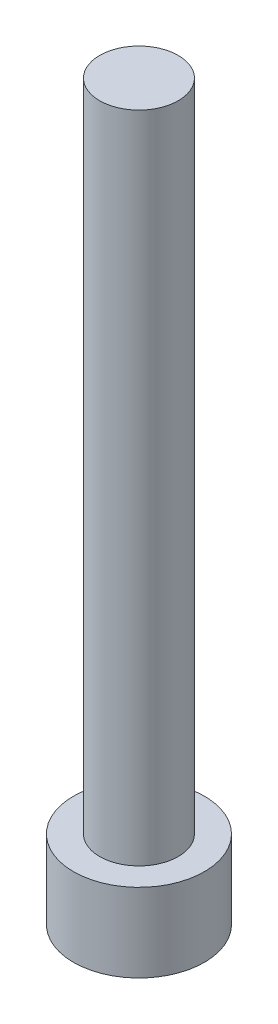
ISO-10303-21;
HEADER;
FILE_DESCRIPTION(('STEP AP214'),'2;1');
FILE_NAME('part.step','',(''),(''),'','','');
FILE_SCHEMA(('AUTOMOTIVE_DESIGN { 1 0 10303 214 1 1 1 1 }'));
ENDSEC;
DATA;
#1=APPLICATION_CONTEXT('core data for automotive mechanical design processes');
#2=APPLICATION_PROTOCOL_DEFINITION('international standard','automotive_design',2000,#1);
#3=PRODUCT_CONTEXT('',#1,'mechanical');
#4=PRODUCT('Part','Part','',(#3));
#5=PRODUCT_RELATED_PRODUCT_CATEGORY('part','',(#4));
#6=PRODUCT_DEFINITION_FORMATION('','',#4);
#7=PRODUCT_DEFINITION_CONTEXT('part definition',#1,'design');
#8=PRODUCT_DEFINITION('design','',#6,#7);
#9=PRODUCT_DEFINITION_SHAPE('','',#8);
#10=(LENGTH_UNIT() NAMED_UNIT(*) SI_UNIT(.MILLI.,.METRE.));
#11=(NAMED_UNIT(*) PLANE_ANGLE_UNIT() SI_UNIT($,.RADIAN.));
#12=(NAMED_UNIT(*) SI_UNIT($,.STERADIAN.) SOLID_ANGLE_UNIT());
#13=UNCERTAINTY_MEASURE_WITH_UNIT(LENGTH_MEASURE(1.E-05),#10,'distance_accuracy_value','');
#14=(GEOMETRIC_REPRESENTATION_CONTEXT(3) GLOBAL_UNCERTAINTY_ASSIGNED_CONTEXT((#13)) GLOBAL_UNIT_ASSIGNED_CONTEXT((#10,
#11,#12)) REPRESENTATION_CONTEXT('',''));
#15=CARTESIAN_POINT('',(0.,0.,0.));
#16=DIRECTION('',(0.,0.,1.));
#17=DIRECTION('',(1.,0.,0.));
#18=AXIS2_PLACEMENT_3D('',#15,#16,#17);
#19=CARTESIAN_POINT('',(0.,3.,0.));
#20=DIRECTION('',(0.,-1.,0.));
#21=DIRECTION('',(0.,0.,-1.));
#22=AXIS2_PLACEMENT_3D('',#19,#20,#21);
#23=CYLINDRICAL_SURFACE('',#22,2.5);
#24=CARTESIAN_POINT('',(0.,3.,0.));
#25=DIRECTION('',(0.,1.,0.));
#26=DIRECTION('',(0.,0.,1.));
#27=AXIS2_PLACEMENT_3D('',#24,#25,#26);
#28=CIRCLE('',#27,2.5);
#29=CARTESIAN_POINT('',(0.,3.,2.5));
#30=VERTEX_POINT('',#29);
#31=EDGE_CURVE('E43',#30,#30,#28,.T.);
#32=ORIENTED_EDGE('',*,*,#31,.F.);
#33=EDGE_LOOP('',(#32));
#34=FACE_BOUND('',#33,.T.);
#35=CARTESIAN_POINT('',(0.,0.,0.));
#36=DIRECTION('',(0.,1.,0.));
#37=DIRECTION('',(0.,0.,1.));
#38=AXIS2_PLACEMENT_3D('',#35,#36,#37);
#39=CIRCLE('',#38,2.5);
#40=CARTESIAN_POINT('',(0.,0.,2.5));
#41=VERTEX_POINT('',#40);
#42=EDGE_CURVE('E38',#41,#41,#39,.T.);
#43=ORIENTED_EDGE('',*,*,#42,.T.);
#44=EDGE_LOOP('',(#43));
#45=FACE_BOUND('',#44,.T.);
#46=ADVANCED_FACE('F35',(#34,#45),#23,.T.);
#47=CARTESIAN_POINT('',(0.,3.,0.));
#48=DIRECTION('',(0.,1.,0.));
#49=DIRECTION('',(0.,0.,1.));
#50=AXIS2_PLACEMENT_3D('',#47,#48,#49);
#51=PLANE('',#50);
#52=CARTESIAN_POINT('',(0.,3.,0.));
#53=DIRECTION('',(0.,1.,0.));
#54=DIRECTION('',(0.,0.,1.));
#55=AXIS2_PLACEMENT_3D('',#52,#53,#54);
#56=CIRCLE('',#55,1.5);
#57=CARTESIAN_POINT('',(0.,3.,1.5));
#58=VERTEX_POINT('',#57);
#59=EDGE_CURVE('E11',#58,#58,#56,.T.);
#60=ORIENTED_EDGE('',*,*,#59,.F.);
#61=EDGE_LOOP('',(#60));
#62=FACE_BOUND('',#61,.T.);
#63=ORIENTED_EDGE('',*,*,#31,.T.);
#64=EDGE_LOOP('',(#63));
#65=FACE_BOUND('',#64,.T.);
#66=ADVANCED_FACE('F155',(#62,#65),#51,.T.);
#67=CARTESIAN_POINT('',(0.,0.,0.));
#68=DIRECTION('',(0.,1.,0.));
#69=DIRECTION('',(0.,0.,1.));
#70=AXIS2_PLACEMENT_3D('',#67,#68,#69);
#71=PLANE('',#70);
#72=DIRECTION('',(-0.5,0.,0.866025403784439));
#73=VECTOR('',#72,1.);
#74=CARTESIAN_POINT('',(1.425,0.,0.));
#75=LINE('',#74,#73);
#76=CARTESIAN_POINT('',(1.425,0.,0.));
#77=VERTEX_POINT('',#76);
#78=CARTESIAN_POINT('',(0.7125,0.,1.23408620039283));
#79=VERTEX_POINT('',#78);
#80=EDGE_CURVE('E125',#77,#79,#75,.T.);
#81=ORIENTED_EDGE('',*,*,#80,.F.);
#82=DIRECTION('',(0.5,0.,0.866025403784439));
#83=VECTOR('',#82,1.);
#84=CARTESIAN_POINT('',(0.7125,0.,-1.23408620039283));
#85=LINE('',#84,#83);
#86=CARTESIAN_POINT('',(0.7125,0.,-1.23408620039283));
#87=VERTEX_POINT('',#86);
#88=EDGE_CURVE('E51',#87,#77,#85,.T.);
#89=ORIENTED_EDGE('',*,*,#88,.F.);
#90=DIRECTION('',(1.,0.,0.));
#91=VECTOR('',#90,1.);
#92=CARTESIAN_POINT('',(-0.7125,0.,-1.23408620039283));
#93=LINE('',#92,#91);
#94=CARTESIAN_POINT('',(-0.7125,0.,-1.23408620039283));
#95=VERTEX_POINT('',#94);
#96=EDGE_CURVE('E134',#95,#87,#93,.T.);
#97=ORIENTED_EDGE('',*,*,#96,.F.);
#98=DIRECTION('',(0.5,0.,-0.866025403784439));
#99=VECTOR('',#98,1.);
#100=CARTESIAN_POINT('',(-1.425,0.,0.));
#101=LINE('',#100,#99);
#102=CARTESIAN_POINT('',(-1.425,0.,0.));
#103=VERTEX_POINT('',#102);
#104=EDGE_CURVE('E132',#103,#95,#101,.T.);
#105=ORIENTED_EDGE('',*,*,#104,.F.);
#106=DIRECTION('',(-0.5,0.,-0.866025403784439));
#107=VECTOR('',#106,1.);
#108=CARTESIAN_POINT('',(-0.7125,0.,1.23408620039283));
#109=LINE('',#108,#107);
#110=CARTESIAN_POINT('',(-0.7125,0.,1.23408620039283));
#111=VERTEX_POINT('',#110);
#112=EDGE_CURVE('E99',#111,#103,#109,.T.);
#113=ORIENTED_EDGE('',*,*,#112,.F.);
#114=DIRECTION('',(-1.,0.,0.));
#115=VECTOR('',#114,1.);
#116=CARTESIAN_POINT('',(0.7125,0.,1.23408620039283));
#117=LINE('',#116,#115);
#118=EDGE_CURVE('E128',#79,#111,#117,.T.);
#119=ORIENTED_EDGE('',*,*,#118,.F.);
#120=EDGE_LOOP('',(#81,#89,#97,#105,#113,#119));
#121=FACE_BOUND('',#120,.T.);
#122=ORIENTED_EDGE('',*,*,#42,.F.);
#123=EDGE_LOOP('',(#122));
#124=FACE_BOUND('',#123,.T.);
#125=ADVANCED_FACE('F152',(#121,#124),#71,.F.);
#126=CARTESIAN_POINT('',(0.,28.,0.));
#127=DIRECTION('',(0.,-1.,0.));
#128=DIRECTION('',(0.,0.,-1.));
#129=AXIS2_PLACEMENT_3D('',#126,#127,#128);
#130=CYLINDRICAL_SURFACE('',#129,1.5);
#131=CARTESIAN_POINT('',(0.,28.,0.));
#132=DIRECTION('',(0.,1.,0.));
#133=DIRECTION('',(0.,0.,1.));
#134=AXIS2_PLACEMENT_3D('',#131,#132,#133);
#135=CIRCLE('',#134,1.5);
#136=CARTESIAN_POINT('',(0.,28.,1.5));
#137=VERTEX_POINT('',#136);
#138=EDGE_CURVE('E138',#137,#137,#135,.T.);
#139=ORIENTED_EDGE('',*,*,#138,.F.);
#140=EDGE_LOOP('',(#139));
#141=FACE_BOUND('',#140,.T.);
#142=ORIENTED_EDGE('',*,*,#59,.T.);
#143=EDGE_LOOP('',(#142));
#144=FACE_BOUND('',#143,.T.);
#145=ADVANCED_FACE('F154',(#141,#144),#130,.T.);
#146=CARTESIAN_POINT('',(0.,28.,0.));
#147=DIRECTION('',(0.,1.,0.));
#148=DIRECTION('',(0.,0.,1.));
#149=AXIS2_PLACEMENT_3D('',#146,#147,#148);
#150=PLANE('',#149);
#151=ORIENTED_EDGE('',*,*,#138,.T.);
#152=EDGE_LOOP('',(#151));
#153=FACE_BOUND('',#152,.T.);
#154=ADVANCED_FACE('F161',(#153),#150,.T.);
#155=CARTESIAN_POINT('',(0.7125,1.65,-1.23408620039283));
#156=DIRECTION('',(0.866025403784439,0.,-0.5));
#157=DIRECTION('',(-0.5,0.,-0.866025403784439));
#158=AXIS2_PLACEMENT_3D('',#155,#156,#157);
#159=PLANE('',#158);
#160=ORIENTED_EDGE('',*,*,#88,.T.);
#161=DIRECTION('',(0.,-1.,0.));
#162=VECTOR('',#161,1.);
#163=CARTESIAN_POINT('',(1.425,1.65,0.));
#164=LINE('',#163,#162);
#165=CARTESIAN_POINT('',(1.425,1.65,0.));
#166=VERTEX_POINT('',#165);
#167=EDGE_CURVE('E81',#166,#77,#164,.T.);
#168=ORIENTED_EDGE('',*,*,#167,.F.);
#169=DIRECTION('',(0.5,0.,0.866025403784439));
#170=VECTOR('',#169,1.);
#171=CARTESIAN_POINT('',(0.7125,1.65,-1.23408620039283));
#172=LINE('',#171,#170);
#173=CARTESIAN_POINT('',(0.7125,1.65,-1.23408620039283));
#174=VERTEX_POINT('',#173);
#175=EDGE_CURVE('E136',#174,#166,#172,.T.);
#176=ORIENTED_EDGE('',*,*,#175,.F.);
#177=DIRECTION('',(0.,-1.,0.));
#178=VECTOR('',#177,1.);
#179=CARTESIAN_POINT('',(0.7125,1.65,-1.23408620039283));
#180=LINE('',#179,#178);
#181=EDGE_CURVE('E59',#174,#87,#180,.T.);
#182=ORIENTED_EDGE('',*,*,#181,.T.);
#183=EDGE_LOOP('',(#160,#168,#176,#182));
#184=FACE_BOUND('',#183,.T.);
#185=ADVANCED_FACE('F190',(#184),#159,.F.);
#186=CARTESIAN_POINT('',(-0.7125,1.65,-1.23408620039283));
#187=DIRECTION('',(0.,0.,-1.));
#188=DIRECTION('',(-1.,0.,0.));
#189=AXIS2_PLACEMENT_3D('',#186,#187,#188);
#190=PLANE('',#189);
#191=ORIENTED_EDGE('',*,*,#96,.T.);
#192=ORIENTED_EDGE('',*,*,#181,.F.);
#193=DIRECTION('',(1.,0.,0.));
#194=VECTOR('',#193,1.);
#195=CARTESIAN_POINT('',(-0.7125,1.65,-1.23408620039283));
#196=LINE('',#195,#194);
#197=CARTESIAN_POINT('',(-0.7125,1.65,-1.23408620039283));
#198=VERTEX_POINT('',#197);
#199=EDGE_CURVE('E111',#198,#174,#196,.T.);
#200=ORIENTED_EDGE('',*,*,#199,.F.);
#201=DIRECTION('',(0.,-1.,0.));
#202=VECTOR('',#201,1.);
#203=CARTESIAN_POINT('',(-0.7125,1.65,-1.23408620039283));
#204=LINE('',#203,#202);
#205=EDGE_CURVE('E103',#198,#95,#204,.T.);
#206=ORIENTED_EDGE('',*,*,#205,.T.);
#207=EDGE_LOOP('',(#191,#192,#200,#206));
#208=FACE_BOUND('',#207,.T.);
#209=ADVANCED_FACE('F204',(#208),#190,.F.);
#210=CARTESIAN_POINT('',(-1.425,1.65,0.));
#211=DIRECTION('',(-0.866025403784439,0.,-0.5));
#212=DIRECTION('',(-0.5,0.,0.866025403784439));
#213=AXIS2_PLACEMENT_3D('',#210,#211,#212);
#214=PLANE('',#213);
#215=ORIENTED_EDGE('',*,*,#104,.T.);
#216=ORIENTED_EDGE('',*,*,#205,.F.);
#217=DIRECTION('',(0.5,0.,-0.866025403784439));
#218=VECTOR('',#217,1.);
#219=CARTESIAN_POINT('',(-1.425,1.65,0.));
#220=LINE('',#219,#218);
#221=CARTESIAN_POINT('',(-1.425,1.65,0.));
#222=VERTEX_POINT('',#221);
#223=EDGE_CURVE('E107',#222,#198,#220,.T.);
#224=ORIENTED_EDGE('',*,*,#223,.F.);
#225=DIRECTION('',(0.,-1.,0.));
#226=VECTOR('',#225,1.);
#227=CARTESIAN_POINT('',(-1.425,1.65,0.));
#228=LINE('',#227,#226);
#229=EDGE_CURVE('E92',#222,#103,#228,.T.);
#230=ORIENTED_EDGE('',*,*,#229,.T.);
#231=EDGE_LOOP('',(#215,#216,#224,#230));
#232=FACE_BOUND('',#231,.T.);
#233=ADVANCED_FACE('F108',(#232),#214,.F.);
#234=CARTESIAN_POINT('',(-0.7125,1.65,1.23408620039283));
#235=DIRECTION('',(-0.866025403784439,0.,0.5));
#236=DIRECTION('',(0.5,0.,0.866025403784439));
#237=AXIS2_PLACEMENT_3D('',#234,#235,#236);
#238=PLANE('',#237);
#239=ORIENTED_EDGE('',*,*,#112,.T.);
#240=ORIENTED_EDGE('',*,*,#229,.F.);
#241=DIRECTION('',(-0.5,0.,-0.866025403784439));
#242=VECTOR('',#241,1.);
#243=CARTESIAN_POINT('',(-0.7125,1.65,1.23408620039283));
#244=LINE('',#243,#242);
#245=CARTESIAN_POINT('',(-0.7125,1.65,1.23408620039283));
#246=VERTEX_POINT('',#245);
#247=EDGE_CURVE('E96',#246,#222,#244,.T.);
#248=ORIENTED_EDGE('',*,*,#247,.F.);
#249=DIRECTION('',(0.,-1.,0.));
#250=VECTOR('',#249,1.);
#251=CARTESIAN_POINT('',(-0.7125,1.65,1.23408620039283));
#252=LINE('',#251,#250);
#253=EDGE_CURVE('E104',#246,#111,#252,.T.);
#254=ORIENTED_EDGE('',*,*,#253,.T.);
#255=EDGE_LOOP('',(#239,#240,#248,#254));
#256=FACE_BOUND('',#255,.T.);
#257=ADVANCED_FACE('F94',(#256),#238,.F.);
#258=CARTESIAN_POINT('',(0.7125,1.65,1.23408620039283));
#259=DIRECTION('',(0.,0.,1.));
#260=DIRECTION('',(1.,0.,0.));
#261=AXIS2_PLACEMENT_3D('',#258,#259,#260);
#262=PLANE('',#261);
#263=ORIENTED_EDGE('',*,*,#118,.T.);
#264=ORIENTED_EDGE('',*,*,#253,.F.);
#265=DIRECTION('',(-1.,0.,0.));
#266=VECTOR('',#265,1.);
#267=CARTESIAN_POINT('',(0.7125,1.65,1.23408620039283));
#268=LINE('',#267,#266);
#269=CARTESIAN_POINT('',(0.7125,1.65,1.23408620039283));
#270=VERTEX_POINT('',#269);
#271=EDGE_CURVE('E117',#270,#246,#268,.T.);
#272=ORIENTED_EDGE('',*,*,#271,.F.);
#273=DIRECTION('',(0.,-1.,0.));
#274=VECTOR('',#273,1.);
#275=CARTESIAN_POINT('',(0.7125,1.65,1.23408620039283));
#276=LINE('',#275,#274);
#277=EDGE_CURVE('E141',#270,#79,#276,.T.);
#278=ORIENTED_EDGE('',*,*,#277,.T.);
#279=EDGE_LOOP('',(#263,#264,#272,#278));
#280=FACE_BOUND('',#279,.T.);
#281=ADVANCED_FACE('F229',(#280),#262,.F.);
#282=CARTESIAN_POINT('',(1.425,1.65,0.));
#283=DIRECTION('',(0.866025403784439,0.,0.5));
#284=DIRECTION('',(0.5,0.,-0.866025403784438));
#285=AXIS2_PLACEMENT_3D('',#282,#283,#284);
#286=PLANE('',#285);
#287=ORIENTED_EDGE('',*,*,#80,.T.);
#288=ORIENTED_EDGE('',*,*,#277,.F.);
#289=DIRECTION('',(-0.5,0.,0.866025403784439));
#290=VECTOR('',#289,1.);
#291=CARTESIAN_POINT('',(1.425,1.65,0.));
#292=LINE('',#291,#290);
#293=EDGE_CURVE('E119',#166,#270,#292,.T.);
#294=ORIENTED_EDGE('',*,*,#293,.F.);
#295=ORIENTED_EDGE('',*,*,#167,.T.);
#296=EDGE_LOOP('',(#287,#288,#294,#295));
#297=FACE_BOUND('',#296,.T.);
#298=ADVANCED_FACE('F238',(#297),#286,.F.);
#299=CARTESIAN_POINT('',(0.,1.65,0.));
#300=DIRECTION('',(0.,-1.,0.));
#301=DIRECTION('',(0.,0.,-1.));
#302=AXIS2_PLACEMENT_3D('',#299,#300,#301);
#303=PLANE('',#302);
#304=ORIENTED_EDGE('',*,*,#175,.T.);
#305=ORIENTED_EDGE('',*,*,#293,.T.);
#306=ORIENTED_EDGE('',*,*,#271,.T.);
#307=ORIENTED_EDGE('',*,*,#247,.T.);
#308=ORIENTED_EDGE('',*,*,#223,.T.);
#309=ORIENTED_EDGE('',*,*,#199,.T.);
#310=EDGE_LOOP('',(#304,#305,#306,#307,#308,#309));
#311=FACE_BOUND('',#310,.T.);
#312=ADVANCED_FACE('F114',(#311),#303,.T.);
#313=CLOSED_SHELL('',(#46,#66,#125,#145,#154,#185,#209,#233,#257,#281,#298,#312));
#314=MANIFOLD_SOLID_BREP('B2',#313);
#315=ADVANCED_BREP_SHAPE_REPRESENTATION('',(#18,#314),#14);
#316=SHAPE_DEFINITION_REPRESENTATION(#9,#315);
ENDSEC;
END-ISO-10303-21;
